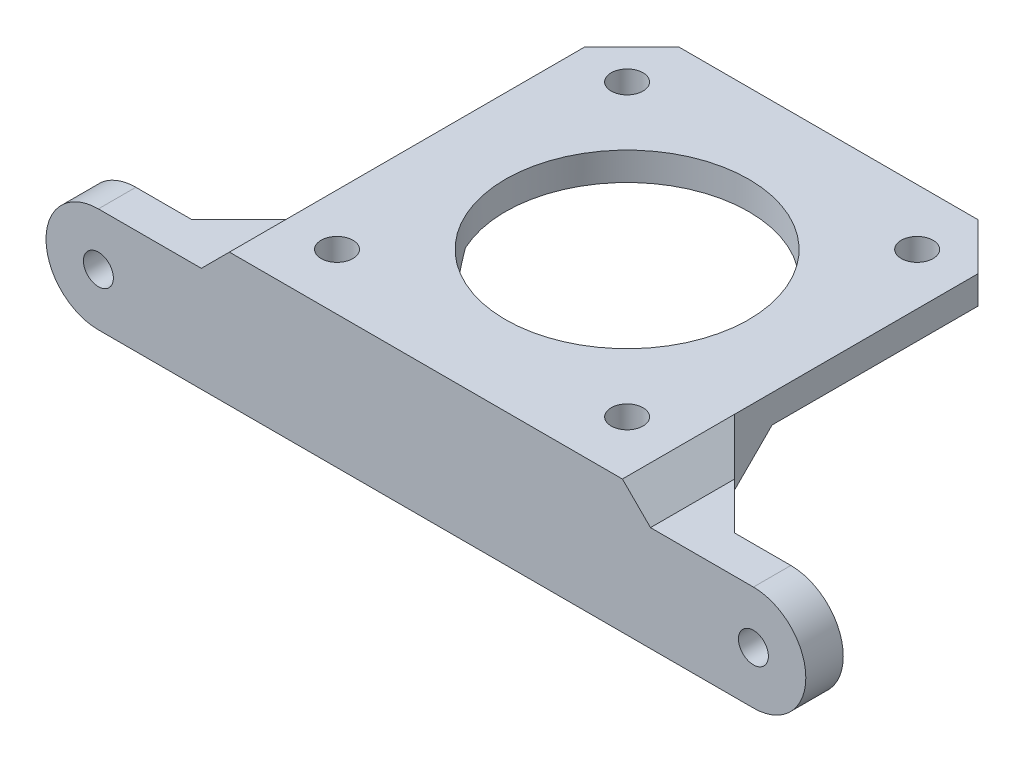
ISO-10303-21;
HEADER;
FILE_DESCRIPTION(('STEP AP214'),'2;1');
FILE_NAME('part.step','',(''),(''),'','','');
FILE_SCHEMA(('AUTOMOTIVE_DESIGN { 1 0 10303 214 1 1 1 1 }'));
ENDSEC;
DATA;
#1=APPLICATION_CONTEXT('core data for automotive mechanical design processes');
#2=APPLICATION_PROTOCOL_DEFINITION('international standard','automotive_design',2000,#1);
#3=PRODUCT_CONTEXT('',#1,'mechanical');
#4=PRODUCT('Part','Part','',(#3));
#5=PRODUCT_RELATED_PRODUCT_CATEGORY('part','',(#4));
#6=PRODUCT_DEFINITION_FORMATION('','',#4);
#7=PRODUCT_DEFINITION_CONTEXT('part definition',#1,'design');
#8=PRODUCT_DEFINITION('design','',#6,#7);
#9=PRODUCT_DEFINITION_SHAPE('','',#8);
#10=(LENGTH_UNIT() NAMED_UNIT(*) SI_UNIT(.MILLI.,.METRE.));
#11=(NAMED_UNIT(*) PLANE_ANGLE_UNIT() SI_UNIT($,.RADIAN.));
#12=(NAMED_UNIT(*) SI_UNIT($,.STERADIAN.) SOLID_ANGLE_UNIT());
#13=UNCERTAINTY_MEASURE_WITH_UNIT(LENGTH_MEASURE(1.E-05),#10,'distance_accuracy_value','');
#14=(GEOMETRIC_REPRESENTATION_CONTEXT(3) GLOBAL_UNCERTAINTY_ASSIGNED_CONTEXT((#13)) GLOBAL_UNIT_ASSIGNED_CONTEXT((#10,
#11,#12)) REPRESENTATION_CONTEXT('',''));
#15=CARTESIAN_POINT('',(0.,0.,0.));
#16=DIRECTION('',(0.,0.,1.));
#17=DIRECTION('',(1.,0.,0.));
#18=AXIS2_PLACEMENT_3D('',#15,#16,#17);
#19=CARTESIAN_POINT('',(0.,5.60000000000002,-12.0000000000002));
#20=DIRECTION('',(0.,-0.707106781186551,-0.707106781186544));
#21=DIRECTION('',(1.,0.,0.));
#22=AXIS2_PLACEMENT_3D('',#19,#20,#21);
#23=PLANE('',#22);
#24=CARTESIAN_POINT('',(15.5,-4.40000000000009,-1.99999999999999));
#25=DIRECTION('',(0.,-0.707106781186551,-0.707106781186544));
#26=DIRECTION('',(0.,0.707106781186544,-0.707106781186551));
#27=AXIS2_PLACEMENT_3D('',#24,#25,#26);
#28=ELLIPSE('',#27,4.94974746830582,3.50000000000001);
#29=CARTESIAN_POINT('',(12.2121435554452,-5.60000000000003,-0.800000000000068));
#30=VERTEX_POINT('',#29);
#31=CARTESIAN_POINT('',(18.7878564445547,-5.6,-0.800000000000068));
#32=VERTEX_POINT('',#31);
#33=EDGE_CURVE('E176',#30,#32,#28,.T.);
#34=ORIENTED_EDGE('',*,*,#33,.F.);
#35=DIRECTION('',(-1.,0.,0.));
#36=VECTOR('',#35,1.);
#37=CARTESIAN_POINT('',(-35.,-5.60000000000001,-0.800000000000069));
#38=LINE('',#37,#36);
#39=CARTESIAN_POINT('',(-12.2121435554453,-5.60000000000004,-0.80000000000004));
#40=VERTEX_POINT('',#39);
#41=EDGE_CURVE('E184',#40,#30,#38,.F.);
#42=ORIENTED_EDGE('',*,*,#41,.F.);
#43=CARTESIAN_POINT('',(-15.5,-4.4000000000001,-1.99999999999999));
#44=DIRECTION('',(0.,-0.707106781186551,-0.707106781186544));
#45=DIRECTION('',(0.,0.707106781186544,-0.707106781186551));
#46=AXIS2_PLACEMENT_3D('',#43,#44,#45);
#47=ELLIPSE('',#46,4.94974746830581,3.5);
#48=CARTESIAN_POINT('',(-18.7878564445547,-5.60000000000001,-0.800000000000069));
#49=VERTEX_POINT('',#48);
#50=EDGE_CURVE('E199',#49,#40,#47,.T.);
#51=ORIENTED_EDGE('',*,*,#50,.F.);
#52=CARTESIAN_POINT('',(-28.2,-5.60000000000001,-0.800000000000069));
#53=VERTEX_POINT('',#52);
#54=EDGE_CURVE('E48',#53,#49,#38,.F.);
#55=ORIENTED_EDGE('',*,*,#54,.F.);
#56=DIRECTION('',(0.577350269189624,0.577350269189624,-0.57735026918963));
#57=VECTOR('',#56,1.);
#58=CARTESIAN_POINT('',(-11.3333333333333,11.2666666666666,-17.6666666666669));
#59=LINE('',#58,#57);
#60=CARTESIAN_POINT('',(-21.,1.59999999999998,-8.00000000000014));
#61=VERTEX_POINT('',#60);
#62=EDGE_CURVE('E11',#53,#61,#59,.T.);
#63=ORIENTED_EDGE('',*,*,#62,.T.);
#64=DIRECTION('',(0.,0.707106781186544,-0.707106781186551));
#65=VECTOR('',#64,1.);
#66=CARTESIAN_POINT('',(-21.,20.5999999999999,-27.0000000000002));
#67=LINE('',#66,#65);
#68=CARTESIAN_POINT('',(-21.,5.60000000000002,-12.0000000000002));
#69=VERTEX_POINT('',#68);
#70=EDGE_CURVE('E194',#69,#61,#67,.F.);
#71=ORIENTED_EDGE('',*,*,#70,.F.);
#72=DIRECTION('',(-1.,0.,0.));
#73=VECTOR('',#72,1.);
#74=CARTESIAN_POINT('',(-21.,5.60000000000002,-12.0000000000002));
#75=LINE('',#74,#73);
#76=CARTESIAN_POINT('',(-11.7792189893898,5.60000000000002,-12.0000000000002));
#77=VERTEX_POINT('',#76);
#78=EDGE_CURVE('E255',#77,#69,#75,.T.);
#79=ORIENTED_EDGE('',*,*,#78,.F.);
#80=CARTESIAN_POINT('',(0.,11.0999999999998,-17.5));
#81=DIRECTION('',(0.,-0.707106781186551,-0.707106781186544));
#82=DIRECTION('',(0.,-0.707106781186544,0.707106781186551));
#83=AXIS2_PLACEMENT_3D('',#80,#81,#82);
#84=ELLIPSE('',#83,18.3847763108501,13.);
#85=CARTESIAN_POINT('',(11.7792189893898,5.60000000000002,-12.0000000000002));
#86=VERTEX_POINT('',#85);
#87=EDGE_CURVE('E249',#86,#77,#84,.T.);
#88=ORIENTED_EDGE('',*,*,#87,.F.);
#89=DIRECTION('',(-1.,0.,0.));
#90=VECTOR('',#89,1.);
#91=CARTESIAN_POINT('',(-21.,5.60000000000002,-12.0000000000002));
#92=LINE('',#91,#90);
#93=CARTESIAN_POINT('',(21.,5.60000000000002,-12.0000000000002));
#94=VERTEX_POINT('',#93);
#95=EDGE_CURVE('E250',#94,#86,#92,.T.);
#96=ORIENTED_EDGE('',*,*,#95,.F.);
#97=DIRECTION('',(0.,-0.707106781186544,0.707106781186551));
#98=VECTOR('',#97,1.);
#99=CARTESIAN_POINT('',(21.,20.5999999999999,-27.0000000000002));
#100=LINE('',#99,#98);
#101=CARTESIAN_POINT('',(21.,1.59999999999999,-8.00000000000014));
#102=VERTEX_POINT('',#101);
#103=EDGE_CURVE('E193',#102,#94,#100,.F.);
#104=ORIENTED_EDGE('',*,*,#103,.F.);
#105=DIRECTION('',(0.577350269189623,-0.577350269189624,0.57735026918963));
#106=VECTOR('',#105,1.);
#107=CARTESIAN_POINT('',(11.3333333333334,11.2666666666666,-17.6666666666669));
#108=LINE('',#107,#106);
#109=CARTESIAN_POINT('',(28.2,-5.6,-0.800000000000068));
#110=VERTEX_POINT('',#109);
#111=EDGE_CURVE('E217',#102,#110,#108,.T.);
#112=ORIENTED_EDGE('',*,*,#111,.T.);
#113=EDGE_CURVE('E186',#32,#110,#38,.F.);
#114=ORIENTED_EDGE('',*,*,#113,.F.);
#115=EDGE_LOOP('',(#34,#42,#51,#55,#63,#71,#79,#88,#96,#104,#112,#114));
#116=FACE_BOUND('',#115,.T.);
#117=ADVANCED_FACE('F32',(#116),#23,.T.);
#118=CARTESIAN_POINT('',(15.5,-5.60000000000002,-1.99999999999999));
#119=DIRECTION('',(0.,1.,0.));
#120=DIRECTION('',(-1.,0.,0.));
#121=AXIS2_PLACEMENT_3D('',#118,#119,#120);
#122=CYLINDRICAL_SURFACE('',#121,1.7);
#123=CARTESIAN_POINT('',(15.5,8.60000000000002,-1.99999999999999));
#124=DIRECTION('',(0.,1.,0.));
#125=DIRECTION('',(-1.,0.,0.));
#126=AXIS2_PLACEMENT_3D('',#123,#124,#125);
#127=CIRCLE('',#126,1.7);
#128=CARTESIAN_POINT('',(13.8,8.60000000000002,-1.99999999999999));
#129=VERTEX_POINT('',#128);
#130=EDGE_CURVE('E363',#129,#129,#127,.T.);
#131=ORIENTED_EDGE('',*,*,#130,.T.);
#132=EDGE_LOOP('',(#131));
#133=FACE_BOUND('',#132,.T.);
#134=CARTESIAN_POINT('',(15.5,5.60000000000002,-1.99999999999999));
#135=DIRECTION('',(0.,-1.,0.));
#136=DIRECTION('',(1.,0.,0.));
#137=AXIS2_PLACEMENT_3D('',#134,#135,#136);
#138=CIRCLE('',#137,1.7);
#139=CARTESIAN_POINT('',(17.2,5.60000000000002,-1.99999999999999));
#140=VERTEX_POINT('',#139);
#141=EDGE_CURVE('E180',#140,#140,#138,.F.);
#142=ORIENTED_EDGE('',*,*,#141,.F.);
#143=EDGE_LOOP('',(#142));
#144=FACE_BOUND('',#143,.T.);
#145=ADVANCED_FACE('F390',(#133,#144),#122,.F.);
#146=CARTESIAN_POINT('',(-15.5,-5.60000000000003,-1.99999999999999));
#147=DIRECTION('',(0.,1.,0.));
#148=DIRECTION('',(-1.,0.,0.));
#149=AXIS2_PLACEMENT_3D('',#146,#147,#148);
#150=CYLINDRICAL_SURFACE('',#149,1.7);
#151=CARTESIAN_POINT('',(-15.5,8.60000000000002,-1.99999999999999));
#152=DIRECTION('',(0.,1.,0.));
#153=DIRECTION('',(1.,0.,0.));
#154=AXIS2_PLACEMENT_3D('',#151,#152,#153);
#155=CIRCLE('',#154,1.7);
#156=CARTESIAN_POINT('',(-13.8,8.60000000000002,-1.99999999999999));
#157=VERTEX_POINT('',#156);
#158=EDGE_CURVE('E203',#157,#157,#155,.T.);
#159=ORIENTED_EDGE('',*,*,#158,.T.);
#160=EDGE_LOOP('',(#159));
#161=FACE_BOUND('',#160,.T.);
#162=CARTESIAN_POINT('',(-15.5,5.60000000000002,-1.99999999999999));
#163=DIRECTION('',(0.,-1.,0.));
#164=DIRECTION('',(1.,0.,0.));
#165=AXIS2_PLACEMENT_3D('',#162,#163,#164);
#166=CIRCLE('',#165,1.7);
#167=CARTESIAN_POINT('',(-13.8,5.60000000000002,-1.99999999999999));
#168=VERTEX_POINT('',#167);
#169=EDGE_CURVE('E200',#168,#168,#166,.F.);
#170=ORIENTED_EDGE('',*,*,#169,.F.);
#171=EDGE_LOOP('',(#170));
#172=FACE_BOUND('',#171,.T.);
#173=ADVANCED_FACE('F395',(#161,#172),#150,.F.);
#174=CARTESIAN_POINT('',(-35.,0.,0.));
#175=DIRECTION('',(0.,0.,1.));
#176=DIRECTION('',(1.,0.,0.));
#177=AXIS2_PLACEMENT_3D('',#174,#175,#176);
#178=PLANE('',#177);
#179=CARTESIAN_POINT('',(-35.,0.,0.));
#180=DIRECTION('',(0.,0.,1.));
#181=DIRECTION('',(1.,0.,0.));
#182=AXIS2_PLACEMENT_3D('',#179,#180,#181);
#183=CIRCLE('',#182,1.60000000000001);
#184=CARTESIAN_POINT('',(-33.4,0.,0.));
#185=VERTEX_POINT('',#184);
#186=EDGE_CURVE('E325',#185,#185,#183,.T.);
#187=ORIENTED_EDGE('',*,*,#186,.T.);
#188=EDGE_LOOP('',(#187));
#189=FACE_BOUND('',#188,.T.);
#190=DIRECTION('',(-1.,0.,0.));
#191=VECTOR('',#190,1.);
#192=CARTESIAN_POINT('',(-35.,5.60000000000001,0.));
#193=LINE('',#192,#191);
#194=CARTESIAN_POINT('',(-29.0000000000001,5.60000000000001,0.));
#195=VERTEX_POINT('',#194);
#196=CARTESIAN_POINT('',(-35.,5.60000000000001,0.));
#197=VERTEX_POINT('',#196);
#198=EDGE_CURVE('E301',#195,#197,#193,.T.);
#199=ORIENTED_EDGE('',*,*,#198,.F.);
#200=DIRECTION('',(0.,-1.,0.));
#201=VECTOR('',#200,1.);
#202=CARTESIAN_POINT('',(-29.0000000000001,-5.60000000000001,0.));
#203=LINE('',#202,#201);
#204=CARTESIAN_POINT('',(-29.0000000000001,-5.60000000000001,0.));
#205=VERTEX_POINT('',#204);
#206=EDGE_CURVE('E215',#195,#205,#203,.T.);
#207=ORIENTED_EDGE('',*,*,#206,.T.);
#208=DIRECTION('',(1.,0.,0.));
#209=VECTOR('',#208,1.);
#210=CARTESIAN_POINT('',(-35.,-5.60000000000001,0.));
#211=LINE('',#210,#209);
#212=CARTESIAN_POINT('',(-35.,-5.60000000000001,0.));
#213=VERTEX_POINT('',#212);
#214=EDGE_CURVE('E233',#213,#205,#211,.T.);
#215=ORIENTED_EDGE('',*,*,#214,.F.);
#216=CARTESIAN_POINT('',(-35.,0.,0.));
#217=DIRECTION('',(0.,0.,1.));
#218=DIRECTION('',(1.,0.,0.));
#219=AXIS2_PLACEMENT_3D('',#216,#217,#218);
#220=CIRCLE('',#219,5.60000000000001);
#221=EDGE_CURVE('E306',#197,#213,#220,.T.);
#222=ORIENTED_EDGE('',*,*,#221,.F.);
#223=EDGE_LOOP('',(#199,#207,#215,#222));
#224=FACE_BOUND('',#223,.T.);
#225=ADVANCED_FACE('F436',(#189,#224),#178,.F.);
#226=CARTESIAN_POINT('',(-35.,5.60000000000001,4.));
#227=DIRECTION('',(0.,-1.,0.));
#228=DIRECTION('',(1.,0.,0.));
#229=AXIS2_PLACEMENT_3D('',#226,#227,#228);
#230=PLANE('',#229);
#231=CARTESIAN_POINT('',(35.,5.60000000000003,0.));
#232=VERTEX_POINT('',#231);
#233=CARTESIAN_POINT('',(29.0000000000001,5.60000000000003,0.));
#234=VERTEX_POINT('',#233);
#235=EDGE_CURVE('E297',#232,#234,#193,.T.);
#236=ORIENTED_EDGE('',*,*,#235,.T.);
#237=DIRECTION('',(0.707106781186543,0.,0.707106781186552));
#238=VECTOR('',#237,1.);
#239=CARTESIAN_POINT('',(-0.999999999999605,5.60000000000002,-30.));
#240=LINE('',#239,#238);
#241=CARTESIAN_POINT('',(24.,5.60000000000002,-5.00000000000012));
#242=VERTEX_POINT('',#241);
#243=EDGE_CURVE('E221',#234,#242,#240,.F.);
#244=ORIENTED_EDGE('',*,*,#243,.T.);
#245=DIRECTION('',(0.,0.,1.));
#246=VECTOR('',#245,1.);
#247=CARTESIAN_POINT('',(24.,5.60000000000002,4.));
#248=LINE('',#247,#246);
#249=CARTESIAN_POINT('',(24.,5.60000000000002,4.));
#250=VERTEX_POINT('',#249);
#251=EDGE_CURVE('E68',#242,#250,#248,.T.);
#252=ORIENTED_EDGE('',*,*,#251,.T.);
#253=DIRECTION('',(-1.,0.,0.));
#254=VECTOR('',#253,1.);
#255=CARTESIAN_POINT('',(-35.,5.60000000000001,4.));
#256=LINE('',#255,#254);
#257=CARTESIAN_POINT('',(35.,5.60000000000003,4.));
#258=VERTEX_POINT('',#257);
#259=EDGE_CURVE('E296',#258,#250,#256,.T.);
#260=ORIENTED_EDGE('',*,*,#259,.F.);
#261=DIRECTION('',(0.,0.,-1.));
#262=VECTOR('',#261,1.);
#263=CARTESIAN_POINT('',(35.,5.60000000000003,4.));
#264=LINE('',#263,#262);
#265=EDGE_CURVE('E290',#258,#232,#264,.T.);
#266=ORIENTED_EDGE('',*,*,#265,.T.);
#267=EDGE_LOOP('',(#236,#244,#252,#260,#266));
#268=FACE_BOUND('',#267,.T.);
#269=ADVANCED_FACE('F412',(#268),#230,.F.);
#270=CARTESIAN_POINT('',(-24.,5.60000000000001,4.));
#271=VERTEX_POINT('',#270);
#272=CARTESIAN_POINT('',(-35.,5.60000000000001,4.));
#273=VERTEX_POINT('',#272);
#274=EDGE_CURVE('E312',#271,#273,#256,.T.);
#275=ORIENTED_EDGE('',*,*,#274,.F.);
#276=DIRECTION('',(0.,0.,-1.));
#277=VECTOR('',#276,1.);
#278=CARTESIAN_POINT('',(-24.,5.60000000000001,0.));
#279=LINE('',#278,#277);
#280=CARTESIAN_POINT('',(-24.,5.60000000000001,-5.00000000000011));
#281=VERTEX_POINT('',#280);
#282=EDGE_CURVE('E282',#271,#281,#279,.T.);
#283=ORIENTED_EDGE('',*,*,#282,.T.);
#284=DIRECTION('',(0.707106781186544,0.,-0.707106781186551));
#285=VECTOR('',#284,1.);
#286=CARTESIAN_POINT('',(-34.,5.60000000000001,4.99999999999999));
#287=LINE('',#286,#285);
#288=EDGE_CURVE('E228',#281,#195,#287,.F.);
#289=ORIENTED_EDGE('',*,*,#288,.T.);
#290=ORIENTED_EDGE('',*,*,#198,.T.);
#291=DIRECTION('',(0.,0.,-1.));
#292=VECTOR('',#291,1.);
#293=CARTESIAN_POINT('',(-35.,5.60000000000001,4.));
#294=LINE('',#293,#292);
#295=EDGE_CURVE('E293',#273,#197,#294,.T.);
#296=ORIENTED_EDGE('',*,*,#295,.F.);
#297=EDGE_LOOP('',(#275,#283,#289,#290,#296));
#298=FACE_BOUND('',#297,.T.);
#299=ADVANCED_FACE('F440',(#298),#230,.F.);
#300=CARTESIAN_POINT('',(-35.,0.,4.));
#301=DIRECTION('',(0.,0.,1.));
#302=DIRECTION('',(1.,0.,0.));
#303=AXIS2_PLACEMENT_3D('',#300,#301,#302);
#304=PLANE('',#303);
#305=CARTESIAN_POINT('',(35.,0.,4.));
#306=DIRECTION('',(0.,0.,1.));
#307=DIRECTION('',(1.,0.,0.));
#308=AXIS2_PLACEMENT_3D('',#305,#306,#307);
#309=CIRCLE('',#308,1.6);
#310=CARTESIAN_POINT('',(36.6,0.,4.));
#311=VERTEX_POINT('',#310);
#312=EDGE_CURVE('E309',#311,#311,#309,.T.);
#313=ORIENTED_EDGE('',*,*,#312,.F.);
#314=EDGE_LOOP('',(#313));
#315=FACE_BOUND('',#314,.T.);
#316=CARTESIAN_POINT('',(-35.,0.,4.));
#317=DIRECTION('',(0.,0.,1.));
#318=DIRECTION('',(1.,0.,0.));
#319=AXIS2_PLACEMENT_3D('',#316,#317,#318);
#320=CIRCLE('',#319,5.60000000000001);
#321=CARTESIAN_POINT('',(-35.,-5.60000000000001,4.));
#322=VERTEX_POINT('',#321);
#323=EDGE_CURVE('E300',#273,#322,#320,.T.);
#324=ORIENTED_EDGE('',*,*,#323,.T.);
#325=DIRECTION('',(1.,0.,0.));
#326=VECTOR('',#325,1.);
#327=CARTESIAN_POINT('',(-35.,-5.60000000000001,4.));
#328=LINE('',#327,#326);
#329=CARTESIAN_POINT('',(35.,-5.6,4.));
#330=VERTEX_POINT('',#329);
#331=EDGE_CURVE('E315',#322,#330,#328,.T.);
#332=ORIENTED_EDGE('',*,*,#331,.T.);
#333=CARTESIAN_POINT('',(35.,0.,4.));
#334=DIRECTION('',(0.,0.,1.));
#335=DIRECTION('',(1.,0.,0.));
#336=AXIS2_PLACEMENT_3D('',#333,#334,#335);
#337=CIRCLE('',#336,5.60000000000001);
#338=EDGE_CURVE('E313',#330,#258,#337,.T.);
#339=ORIENTED_EDGE('',*,*,#338,.T.);
#340=ORIENTED_EDGE('',*,*,#259,.T.);
#341=DIRECTION('',(0.707106781186544,-0.707106781186551,0.));
#342=VECTOR('',#341,1.);
#343=CARTESIAN_POINT('',(21.,8.60000000000004,4.));
#344=LINE('',#343,#342);
#345=CARTESIAN_POINT('',(21.,8.60000000000002,4.));
#346=VERTEX_POINT('',#345);
#347=EDGE_CURVE('E280',#250,#346,#344,.F.);
#348=ORIENTED_EDGE('',*,*,#347,.T.);
#349=DIRECTION('',(1.,0.,0.));
#350=VECTOR('',#349,1.);
#351=CARTESIAN_POINT('',(-21.,8.60000000000002,4.));
#352=LINE('',#351,#350);
#353=CARTESIAN_POINT('',(-21.,8.60000000000002,4.));
#354=VERTEX_POINT('',#353);
#355=EDGE_CURVE('E328',#354,#346,#352,.T.);
#356=ORIENTED_EDGE('',*,*,#355,.F.);
#357=DIRECTION('',(0.707106781186543,0.707106781186552,0.));
#358=VECTOR('',#357,1.);
#359=CARTESIAN_POINT('',(-21.,8.60000000000006,4.));
#360=LINE('',#359,#358);
#361=EDGE_CURVE('E278',#354,#271,#360,.F.);
#362=ORIENTED_EDGE('',*,*,#361,.T.);
#363=ORIENTED_EDGE('',*,*,#274,.T.);
#364=EDGE_LOOP('',(#324,#332,#339,#340,#348,#356,#362,#363));
#365=FACE_BOUND('',#364,.T.);
#366=CARTESIAN_POINT('',(-35.,0.,4.));
#367=DIRECTION('',(0.,0.,1.));
#368=DIRECTION('',(1.,0.,0.));
#369=AXIS2_PLACEMENT_3D('',#366,#367,#368);
#370=CIRCLE('',#369,1.60000000000001);
#371=CARTESIAN_POINT('',(-33.4,0.,4.));
#372=VERTEX_POINT('',#371);
#373=EDGE_CURVE('E322',#372,#372,#370,.T.);
#374=ORIENTED_EDGE('',*,*,#373,.F.);
#375=EDGE_LOOP('',(#374));
#376=FACE_BOUND('',#375,.T.);
#377=ADVANCED_FACE('F426',(#315,#365,#376),#304,.T.);
#378=CARTESIAN_POINT('',(29.0000000000001,-5.6,0.));
#379=VERTEX_POINT('',#378);
#380=CARTESIAN_POINT('',(35.,-5.6,0.));
#381=VERTEX_POINT('',#380);
#382=EDGE_CURVE('E305',#379,#381,#211,.T.);
#383=ORIENTED_EDGE('',*,*,#382,.F.);
#384=DIRECTION('',(0.,1.,0.));
#385=VECTOR('',#384,1.);
#386=CARTESIAN_POINT('',(29.,8.60000000000003,0.));
#387=LINE('',#386,#385);
#388=EDGE_CURVE('E210',#379,#234,#387,.T.);
#389=ORIENTED_EDGE('',*,*,#388,.T.);
#390=ORIENTED_EDGE('',*,*,#235,.F.);
#391=CARTESIAN_POINT('',(35.,0.,0.));
#392=DIRECTION('',(0.,0.,1.));
#393=DIRECTION('',(1.,0.,0.));
#394=AXIS2_PLACEMENT_3D('',#391,#392,#393);
#395=CIRCLE('',#394,5.60000000000001);
#396=EDGE_CURVE('E302',#381,#232,#395,.T.);
#397=ORIENTED_EDGE('',*,*,#396,.F.);
#398=EDGE_LOOP('',(#383,#389,#390,#397));
#399=FACE_BOUND('',#398,.T.);
#400=CARTESIAN_POINT('',(35.,0.,0.));
#401=DIRECTION('',(0.,0.,1.));
#402=DIRECTION('',(1.,0.,0.));
#403=AXIS2_PLACEMENT_3D('',#400,#401,#402);
#404=CIRCLE('',#403,1.6);
#405=CARTESIAN_POINT('',(36.6,0.,0.));
#406=VERTEX_POINT('',#405);
#407=EDGE_CURVE('E319',#406,#406,#404,.T.);
#408=ORIENTED_EDGE('',*,*,#407,.T.);
#409=EDGE_LOOP('',(#408));
#410=FACE_BOUND('',#409,.T.);
#411=ADVANCED_FACE('F419',(#399,#410),#178,.F.);
#412=CARTESIAN_POINT('',(-35.,0.,4.));
#413=DIRECTION('',(0.,0.,-1.));
#414=DIRECTION('',(-1.,0.,0.));
#415=AXIS2_PLACEMENT_3D('',#412,#413,#414);
#416=CYLINDRICAL_SURFACE('',#415,5.60000000000001);
#417=ORIENTED_EDGE('',*,*,#221,.T.);
#418=DIRECTION('',(0.,0.,-1.));
#419=VECTOR('',#418,1.);
#420=CARTESIAN_POINT('',(-35.,-5.60000000000001,4.));
#421=LINE('',#420,#419);
#422=EDGE_CURVE('E285',#322,#213,#421,.T.);
#423=ORIENTED_EDGE('',*,*,#422,.F.);
#424=ORIENTED_EDGE('',*,*,#323,.F.);
#425=ORIENTED_EDGE('',*,*,#295,.T.);
#426=EDGE_LOOP('',(#417,#423,#424,#425));
#427=FACE_BOUND('',#426,.T.);
#428=ADVANCED_FACE('F432',(#427),#416,.T.);
#429=CARTESIAN_POINT('',(-35.,-5.60000000000001,4.));
#430=DIRECTION('',(0.,1.,0.));
#431=DIRECTION('',(-1.,0.,0.));
#432=AXIS2_PLACEMENT_3D('',#429,#430,#431);
#433=PLANE('',#432);
#434=CARTESIAN_POINT('',(15.5,-5.60000000000003,-1.99999999999999));
#435=DIRECTION('',(0.,-1.,0.));
#436=DIRECTION('',(1.,0.,0.));
#437=AXIS2_PLACEMENT_3D('',#434,#435,#436);
#438=CIRCLE('',#437,3.50000000000001);
#439=EDGE_CURVE('E173',#32,#30,#438,.T.);
#440=ORIENTED_EDGE('',*,*,#439,.F.);
#441=ORIENTED_EDGE('',*,*,#113,.T.);
#442=DIRECTION('',(-0.707106781186543,0.,-0.707106781186552));
#443=VECTOR('',#442,1.);
#444=CARTESIAN_POINT('',(-0.999999999999605,-5.60000000000001,-30.));
#445=LINE('',#444,#443);
#446=EDGE_CURVE('E219',#110,#379,#445,.F.);
#447=ORIENTED_EDGE('',*,*,#446,.T.);
#448=ORIENTED_EDGE('',*,*,#382,.T.);
#449=DIRECTION('',(0.,0.,-1.));
#450=VECTOR('',#449,1.);
#451=CARTESIAN_POINT('',(35.,-5.6,4.));
#452=LINE('',#451,#450);
#453=EDGE_CURVE('E287',#330,#381,#452,.T.);
#454=ORIENTED_EDGE('',*,*,#453,.F.);
#455=ORIENTED_EDGE('',*,*,#331,.F.);
#456=ORIENTED_EDGE('',*,*,#422,.T.);
#457=ORIENTED_EDGE('',*,*,#214,.T.);
#458=DIRECTION('',(-0.707106781186544,0.,0.707106781186551));
#459=VECTOR('',#458,1.);
#460=CARTESIAN_POINT('',(-34.,-5.60000000000001,4.99999999999999));
#461=LINE('',#460,#459);
#462=EDGE_CURVE('E41',#205,#53,#461,.F.);
#463=ORIENTED_EDGE('',*,*,#462,.T.);
#464=ORIENTED_EDGE('',*,*,#54,.T.);
#465=CARTESIAN_POINT('',(-15.5,-5.60000000000004,-1.99999999999999));
#466=DIRECTION('',(0.,-1.,0.));
#467=DIRECTION('',(1.,0.,0.));
#468=AXIS2_PLACEMENT_3D('',#465,#466,#467);
#469=CIRCLE('',#468,3.5);
#470=EDGE_CURVE('E191',#40,#49,#469,.T.);
#471=ORIENTED_EDGE('',*,*,#470,.F.);
#472=ORIENTED_EDGE('',*,*,#41,.T.);
#473=EDGE_LOOP('',(#440,#441,#447,#448,#454,#455,#456,#457,#463,#464,#471,#472));
#474=FACE_BOUND('',#473,.T.);
#475=ADVANCED_FACE('F190',(#474),#433,.F.);
#476=CARTESIAN_POINT('',(35.,0.,4.));
#477=DIRECTION('',(0.,0.,-1.));
#478=DIRECTION('',(-1.,0.,0.));
#479=AXIS2_PLACEMENT_3D('',#476,#477,#478);
#480=CYLINDRICAL_SURFACE('',#479,5.60000000000001);
#481=ORIENTED_EDGE('',*,*,#396,.T.);
#482=ORIENTED_EDGE('',*,*,#265,.F.);
#483=ORIENTED_EDGE('',*,*,#338,.F.);
#484=ORIENTED_EDGE('',*,*,#453,.T.);
#485=EDGE_LOOP('',(#481,#482,#483,#484));
#486=FACE_BOUND('',#485,.T.);
#487=ADVANCED_FACE('F424',(#486),#480,.T.);
#488=CARTESIAN_POINT('',(35.,0.,4.));
#489=DIRECTION('',(0.,0.,-1.));
#490=DIRECTION('',(-1.,0.,0.));
#491=AXIS2_PLACEMENT_3D('',#488,#489,#490);
#492=CYLINDRICAL_SURFACE('',#491,1.6);
#493=ORIENTED_EDGE('',*,*,#312,.T.);
#494=EDGE_LOOP('',(#493));
#495=FACE_BOUND('',#494,.T.);
#496=ORIENTED_EDGE('',*,*,#407,.F.);
#497=EDGE_LOOP('',(#496));
#498=FACE_BOUND('',#497,.T.);
#499=ADVANCED_FACE('F486',(#495,#498),#492,.F.);
#500=CARTESIAN_POINT('',(-35.,0.,4.));
#501=DIRECTION('',(0.,0.,-1.));
#502=DIRECTION('',(-1.,0.,0.));
#503=AXIS2_PLACEMENT_3D('',#500,#501,#502);
#504=CYLINDRICAL_SURFACE('',#503,1.60000000000001);
#505=ORIENTED_EDGE('',*,*,#373,.T.);
#506=EDGE_LOOP('',(#505));
#507=FACE_BOUND('',#506,.T.);
#508=ORIENTED_EDGE('',*,*,#186,.F.);
#509=EDGE_LOOP('',(#508));
#510=FACE_BOUND('',#509,.T.);
#511=ADVANCED_FACE('F477',(#507,#510),#504,.F.);
#512=CARTESIAN_POINT('',(0.,5.60000000000002,0.));
#513=DIRECTION('',(0.,1.,0.));
#514=DIRECTION('',(-1.,0.,0.));
#515=AXIS2_PLACEMENT_3D('',#512,#513,#514);
#516=PLANE('',#515);
#517=DIRECTION('',(0.,0.,-1.));
#518=VECTOR('',#517,1.);
#519=CARTESIAN_POINT('',(21.,5.60000000000002,-39.));
#520=LINE('',#519,#518);
#521=CARTESIAN_POINT('',(21.,5.60000000000002,-34.));
#522=VERTEX_POINT('',#521);
#523=EDGE_CURVE('E336',#94,#522,#520,.T.);
#524=ORIENTED_EDGE('',*,*,#523,.F.);
#525=ORIENTED_EDGE('',*,*,#95,.T.);
#526=CARTESIAN_POINT('',(0.,5.60000000000002,-17.5));
#527=DIRECTION('',(0.,1.,0.));
#528=DIRECTION('',(-1.,0.,0.));
#529=AXIS2_PLACEMENT_3D('',#526,#527,#528);
#530=CIRCLE('',#529,13.);
#531=EDGE_CURVE('E347',#86,#77,#530,.T.);
#532=ORIENTED_EDGE('',*,*,#531,.T.);
#533=ORIENTED_EDGE('',*,*,#78,.T.);
#534=DIRECTION('',(0.,0.,1.));
#535=VECTOR('',#534,1.);
#536=CARTESIAN_POINT('',(-21.,5.60000000000002,-39.));
#537=LINE('',#536,#535);
#538=CARTESIAN_POINT('',(-21.,5.60000000000002,-34.));
#539=VERTEX_POINT('',#538);
#540=EDGE_CURVE('E248',#539,#69,#537,.T.);
#541=ORIENTED_EDGE('',*,*,#540,.F.);
#542=DIRECTION('',(-0.707106781186549,0.,0.707106781186547));
#543=VECTOR('',#542,1.);
#544=CARTESIAN_POINT('',(-21.,5.60000000000002,-34.));
#545=LINE('',#544,#543);
#546=CARTESIAN_POINT('',(-16.,5.60000000000002,-39.));
#547=VERTEX_POINT('',#546);
#548=EDGE_CURVE('E271',#539,#547,#545,.F.);
#549=ORIENTED_EDGE('',*,*,#548,.T.);
#550=DIRECTION('',(-1.,0.,0.));
#551=VECTOR('',#550,1.);
#552=CARTESIAN_POINT('',(-21.,5.60000000000002,-39.));
#553=LINE('',#552,#551);
#554=CARTESIAN_POINT('',(16.,5.60000000000002,-39.));
#555=VERTEX_POINT('',#554);
#556=EDGE_CURVE('E333',#555,#547,#553,.T.);
#557=ORIENTED_EDGE('',*,*,#556,.F.);
#558=DIRECTION('',(-0.707106781186545,0.,-0.70710678118655));
#559=VECTOR('',#558,1.);
#560=CARTESIAN_POINT('',(16.,5.60000000000002,-39.));
#561=LINE('',#560,#559);
#562=EDGE_CURVE('E268',#555,#522,#561,.F.);
#563=ORIENTED_EDGE('',*,*,#562,.T.);
#564=EDGE_LOOP('',(#524,#525,#532,#533,#541,#549,#557,#563));
#565=FACE_BOUND('',#564,.T.);
#566=CARTESIAN_POINT('',(-15.5,5.60000000000002,-33.));
#567=DIRECTION('',(0.,1.,0.));
#568=DIRECTION('',(-1.,0.,0.));
#569=AXIS2_PLACEMENT_3D('',#566,#567,#568);
#570=CIRCLE('',#569,1.7);
#571=CARTESIAN_POINT('',(-17.2,5.60000000000002,-33.));
#572=VERTEX_POINT('',#571);
#573=EDGE_CURVE('E349',#572,#572,#570,.T.);
#574=ORIENTED_EDGE('',*,*,#573,.T.);
#575=EDGE_LOOP('',(#574));
#576=FACE_BOUND('',#575,.T.);
#577=CARTESIAN_POINT('',(15.5,5.60000000000002,-33.));
#578=DIRECTION('',(0.,1.,0.));
#579=DIRECTION('',(-1.,0.,0.));
#580=AXIS2_PLACEMENT_3D('',#577,#578,#579);
#581=CIRCLE('',#580,1.7);
#582=CARTESIAN_POINT('',(13.8,5.60000000000002,-33.));
#583=VERTEX_POINT('',#582);
#584=EDGE_CURVE('E357',#583,#583,#581,.T.);
#585=ORIENTED_EDGE('',*,*,#584,.T.);
#586=EDGE_LOOP('',(#585));
#587=FACE_BOUND('',#586,.T.);
#588=ADVANCED_FACE('F456',(#565,#576,#587),#516,.F.);
#589=CARTESIAN_POINT('',(0.,8.60000000000002,0.));
#590=DIRECTION('',(0.,1.,0.));
#591=DIRECTION('',(-1.,0.,0.));
#592=AXIS2_PLACEMENT_3D('',#589,#590,#591);
#593=PLANE('',#592);
#594=CARTESIAN_POINT('',(15.5,8.60000000000002,-33.));
#595=DIRECTION('',(0.,1.,0.));
#596=DIRECTION('',(1.,0.,0.));
#597=AXIS2_PLACEMENT_3D('',#594,#595,#596);
#598=CIRCLE('',#597,1.7);
#599=CARTESIAN_POINT('',(17.2,8.60000000000002,-33.));
#600=VERTEX_POINT('',#599);
#601=EDGE_CURVE('E360',#600,#600,#598,.T.);
#602=ORIENTED_EDGE('',*,*,#601,.F.);
#603=EDGE_LOOP('',(#602));
#604=FACE_BOUND('',#603,.T.);
#605=ORIENTED_EDGE('',*,*,#130,.F.);
#606=EDGE_LOOP('',(#605));
#607=FACE_BOUND('',#606,.T.);
#608=ORIENTED_EDGE('',*,*,#158,.F.);
#609=EDGE_LOOP('',(#608));
#610=FACE_BOUND('',#609,.T.);
#611=CARTESIAN_POINT('',(-15.5,8.60000000000002,-33.));
#612=DIRECTION('',(0.,1.,0.));
#613=DIRECTION('',(-1.,0.,0.));
#614=AXIS2_PLACEMENT_3D('',#611,#612,#613);
#615=CIRCLE('',#614,1.7);
#616=CARTESIAN_POINT('',(-17.2,8.60000000000002,-33.));
#617=VERTEX_POINT('',#616);
#618=EDGE_CURVE('E354',#617,#617,#615,.T.);
#619=ORIENTED_EDGE('',*,*,#618,.F.);
#620=EDGE_LOOP('',(#619));
#621=FACE_BOUND('',#620,.T.);
#622=DIRECTION('',(0.,0.,-1.));
#623=VECTOR('',#622,1.);
#624=CARTESIAN_POINT('',(21.,8.60000000000002,-39.));
#625=LINE('',#624,#623);
#626=CARTESIAN_POINT('',(21.,8.60000000000002,-8.00000000000014));
#627=VERTEX_POINT('',#626);
#628=EDGE_CURVE('E60',#346,#627,#625,.T.);
#629=ORIENTED_EDGE('',*,*,#628,.T.);
#630=CARTESIAN_POINT('',(21.,8.60000000000002,-34.));
#631=VERTEX_POINT('',#630);
#632=EDGE_CURVE('E332',#627,#631,#625,.T.);
#633=ORIENTED_EDGE('',*,*,#632,.T.);
#634=DIRECTION('',(0.707106781186545,0.,0.70710678118655));
#635=VECTOR('',#634,1.);
#636=CARTESIAN_POINT('',(27.5,8.60000000000003,-27.4999999999999));
#637=LINE('',#636,#635);
#638=CARTESIAN_POINT('',(16.,8.60000000000002,-39.));
#639=VERTEX_POINT('',#638);
#640=EDGE_CURVE('E261',#631,#639,#637,.F.);
#641=ORIENTED_EDGE('',*,*,#640,.T.);
#642=DIRECTION('',(-1.,0.,0.));
#643=VECTOR('',#642,1.);
#644=CARTESIAN_POINT('',(-21.,8.60000000000002,-39.));
#645=LINE('',#644,#643);
#646=CARTESIAN_POINT('',(-16.,8.60000000000002,-39.));
#647=VERTEX_POINT('',#646);
#648=EDGE_CURVE('E343',#639,#647,#645,.T.);
#649=ORIENTED_EDGE('',*,*,#648,.T.);
#650=DIRECTION('',(0.707106781186549,0.,-0.707106781186547));
#651=VECTOR('',#650,1.);
#652=CARTESIAN_POINT('',(-27.5,8.60000000000002,-27.5000000000001));
#653=LINE('',#652,#651);
#654=CARTESIAN_POINT('',(-21.,8.60000000000002,-34.));
#655=VERTEX_POINT('',#654);
#656=EDGE_CURVE('E263',#647,#655,#653,.F.);
#657=ORIENTED_EDGE('',*,*,#656,.T.);
#658=DIRECTION('',(0.,0.,1.));
#659=VECTOR('',#658,1.);
#660=CARTESIAN_POINT('',(-21.,8.60000000000002,-39.));
#661=LINE('',#660,#659);
#662=CARTESIAN_POINT('',(-21.,8.60000000000002,-8.00000000000014));
#663=VERTEX_POINT('',#662);
#664=EDGE_CURVE('E340',#655,#663,#661,.T.);
#665=ORIENTED_EDGE('',*,*,#664,.T.);
#666=EDGE_CURVE('E342',#663,#354,#661,.T.);
#667=ORIENTED_EDGE('',*,*,#666,.T.);
#668=ORIENTED_EDGE('',*,*,#355,.T.);
#669=EDGE_LOOP('',(#629,#633,#641,#649,#657,#665,#667,#668));
#670=FACE_BOUND('',#669,.T.);
#671=CARTESIAN_POINT('',(0.,8.60000000000002,-17.5));
#672=DIRECTION('',(0.,1.,0.));
#673=DIRECTION('',(-1.,0.,0.));
#674=AXIS2_PLACEMENT_3D('',#671,#672,#673);
#675=CIRCLE('',#674,13.);
#676=CARTESIAN_POINT('',(-13.,8.60000000000002,-17.5));
#677=VERTEX_POINT('',#676);
#678=EDGE_CURVE('E338',#677,#677,#675,.T.);
#679=ORIENTED_EDGE('',*,*,#678,.F.);
#680=EDGE_LOOP('',(#679));
#681=FACE_BOUND('',#680,.T.);
#682=ADVANCED_FACE('F447',(#604,#607,#610,#621,#670,#681),#593,.T.);
#683=CARTESIAN_POINT('',(21.,8.60000000000002,-39.));
#684=DIRECTION('',(-1.,0.,0.));
#685=DIRECTION('',(0.,-1.,0.));
#686=AXIS2_PLACEMENT_3D('',#683,#684,#685);
#687=PLANE('',#686);
#688=ORIENTED_EDGE('',*,*,#632,.F.);
#689=DIRECTION('',(0.,-1.,0.));
#690=VECTOR('',#689,1.);
#691=CARTESIAN_POINT('',(21.,-5.6,-8.00000000000014));
#692=LINE('',#691,#690);
#693=EDGE_CURVE('E205',#627,#102,#692,.T.);
#694=ORIENTED_EDGE('',*,*,#693,.T.);
#695=ORIENTED_EDGE('',*,*,#103,.T.);
#696=ORIENTED_EDGE('',*,*,#523,.T.);
#697=DIRECTION('',(0.,1.,0.));
#698=VECTOR('',#697,1.);
#699=CARTESIAN_POINT('',(21.,8.60000000000002,-34.));
#700=LINE('',#699,#698);
#701=EDGE_CURVE('E265',#522,#631,#700,.T.);
#702=ORIENTED_EDGE('',*,*,#701,.T.);
#703=EDGE_LOOP('',(#688,#694,#695,#696,#702));
#704=FACE_BOUND('',#703,.T.);
#705=ADVANCED_FACE('F452',(#704),#687,.F.);
#706=CARTESIAN_POINT('',(-21.,8.60000000000002,-39.));
#707=DIRECTION('',(0.,0.,1.));
#708=DIRECTION('',(1.,0.,0.));
#709=AXIS2_PLACEMENT_3D('',#706,#707,#708);
#710=PLANE('',#709);
#711=ORIENTED_EDGE('',*,*,#648,.F.);
#712=DIRECTION('',(0.,-1.,0.));
#713=VECTOR('',#712,1.);
#714=CARTESIAN_POINT('',(16.,8.60000000000002,-39.));
#715=LINE('',#714,#713);
#716=EDGE_CURVE('E273',#639,#555,#715,.T.);
#717=ORIENTED_EDGE('',*,*,#716,.T.);
#718=ORIENTED_EDGE('',*,*,#556,.T.);
#719=DIRECTION('',(0.,1.,0.));
#720=VECTOR('',#719,1.);
#721=CARTESIAN_POINT('',(-16.,8.60000000000002,-39.));
#722=LINE('',#721,#720);
#723=EDGE_CURVE('E276',#547,#647,#722,.T.);
#724=ORIENTED_EDGE('',*,*,#723,.T.);
#725=EDGE_LOOP('',(#711,#717,#718,#724));
#726=FACE_BOUND('',#725,.T.);
#727=ADVANCED_FACE('F467',(#726),#710,.F.);
#728=CARTESIAN_POINT('',(-21.,8.60000000000002,-39.));
#729=DIRECTION('',(1.,0.,0.));
#730=DIRECTION('',(0.,1.,0.));
#731=AXIS2_PLACEMENT_3D('',#728,#729,#730);
#732=PLANE('',#731);
#733=ORIENTED_EDGE('',*,*,#70,.T.);
#734=DIRECTION('',(0.,1.,0.));
#735=VECTOR('',#734,1.);
#736=CARTESIAN_POINT('',(-21.,8.60000000000002,-8.00000000000014));
#737=LINE('',#736,#735);
#738=EDGE_CURVE('E212',#61,#663,#737,.T.);
#739=ORIENTED_EDGE('',*,*,#738,.T.);
#740=ORIENTED_EDGE('',*,*,#664,.F.);
#741=DIRECTION('',(0.,-1.,0.));
#742=VECTOR('',#741,1.);
#743=CARTESIAN_POINT('',(-21.,8.60000000000002,-34.));
#744=LINE('',#743,#742);
#745=EDGE_CURVE('E259',#655,#539,#744,.T.);
#746=ORIENTED_EDGE('',*,*,#745,.T.);
#747=ORIENTED_EDGE('',*,*,#540,.T.);
#748=EDGE_LOOP('',(#733,#739,#740,#746,#747));
#749=FACE_BOUND('',#748,.T.);
#750=ADVANCED_FACE('F243',(#749),#732,.F.);
#751=CARTESIAN_POINT('',(0.,8.60000000000002,-17.5));
#752=DIRECTION('',(0.,-1.,0.));
#753=DIRECTION('',(1.,0.,0.));
#754=AXIS2_PLACEMENT_3D('',#751,#752,#753);
#755=CYLINDRICAL_SURFACE('',#754,13.);
#756=ORIENTED_EDGE('',*,*,#678,.T.);
#757=EDGE_LOOP('',(#756));
#758=FACE_BOUND('',#757,.T.);
#759=ORIENTED_EDGE('',*,*,#531,.F.);
#760=ORIENTED_EDGE('',*,*,#87,.T.);
#761=EDGE_LOOP('',(#759,#760));
#762=FACE_BOUND('',#761,.T.);
#763=ADVANCED_FACE('F458',(#758,#762),#755,.F.);
#764=CARTESIAN_POINT('',(21.,8.60000000000004,-39.));
#765=DIRECTION('',(0.707106781186551,0.707106781186544,0.));
#766=DIRECTION('',(0.,0.,1.));
#767=AXIS2_PLACEMENT_3D('',#764,#765,#766);
#768=PLANE('',#767);
#769=ORIENTED_EDGE('',*,*,#347,.F.);
#770=ORIENTED_EDGE('',*,*,#251,.F.);
#771=DIRECTION('',(-0.577350269189622,0.577350269189627,-0.577350269189629));
#772=VECTOR('',#771,1.);
#773=CARTESIAN_POINT('',(10.6666666666667,18.9333333333334,-18.3333333333335));
#774=LINE('',#773,#772);
#775=EDGE_CURVE('E223',#242,#627,#774,.T.);
#776=ORIENTED_EDGE('',*,*,#775,.T.);
#777=ORIENTED_EDGE('',*,*,#628,.F.);
#778=EDGE_LOOP('',(#769,#770,#776,#777));
#779=FACE_BOUND('',#778,.T.);
#780=ADVANCED_FACE('F449',(#779),#768,.T.);
#781=CARTESIAN_POINT('',(-21.,8.60000000000006,-39.));
#782=DIRECTION('',(-0.707106781186552,0.707106781186543,0.));
#783=DIRECTION('',(0.,0.,-1.));
#784=AXIS2_PLACEMENT_3D('',#781,#782,#783);
#785=PLANE('',#784);
#786=ORIENTED_EDGE('',*,*,#666,.F.);
#787=DIRECTION('',(-0.577350269189621,-0.577350269189629,0.577350269189627));
#788=VECTOR('',#787,1.);
#789=CARTESIAN_POINT('',(-10.6666666666668,18.9333333333334,-18.3333333333335));
#790=LINE('',#789,#788);
#791=EDGE_CURVE('E225',#663,#281,#790,.T.);
#792=ORIENTED_EDGE('',*,*,#791,.T.);
#793=ORIENTED_EDGE('',*,*,#282,.F.);
#794=ORIENTED_EDGE('',*,*,#361,.F.);
#795=EDGE_LOOP('',(#786,#792,#793,#794));
#796=FACE_BOUND('',#795,.T.);
#797=ADVANCED_FACE('F444',(#796),#785,.T.);
#798=CARTESIAN_POINT('',(16.,8.60000000000002,-39.));
#799=DIRECTION('',(-0.70710678118655,0.,0.707106781186545));
#800=DIRECTION('',(0.,-1.,0.));
#801=AXIS2_PLACEMENT_3D('',#798,#799,#800);
#802=PLANE('',#801);
#803=ORIENTED_EDGE('',*,*,#640,.F.);
#804=ORIENTED_EDGE('',*,*,#701,.F.);
#805=ORIENTED_EDGE('',*,*,#562,.F.);
#806=ORIENTED_EDGE('',*,*,#716,.F.);
#807=EDGE_LOOP('',(#803,#804,#805,#806));
#808=FACE_BOUND('',#807,.T.);
#809=ADVANCED_FACE('F505',(#808),#802,.F.);
#810=CARTESIAN_POINT('',(-21.,8.60000000000002,-34.));
#811=DIRECTION('',(0.707106781186546,0.,0.707106781186548));
#812=DIRECTION('',(0.,-1.,0.));
#813=AXIS2_PLACEMENT_3D('',#810,#811,#812);
#814=PLANE('',#813);
#815=ORIENTED_EDGE('',*,*,#656,.F.);
#816=ORIENTED_EDGE('',*,*,#723,.F.);
#817=ORIENTED_EDGE('',*,*,#548,.F.);
#818=ORIENTED_EDGE('',*,*,#745,.F.);
#819=EDGE_LOOP('',(#815,#816,#817,#818));
#820=FACE_BOUND('',#819,.T.);
#821=ADVANCED_FACE('F399',(#820),#814,.F.);
#822=CARTESIAN_POINT('',(-15.5,-5.60000000000003,-33.));
#823=DIRECTION('',(0.,1.,0.));
#824=DIRECTION('',(-1.,0.,0.));
#825=AXIS2_PLACEMENT_3D('',#822,#823,#824);
#826=CYLINDRICAL_SURFACE('',#825,1.7);
#827=ORIENTED_EDGE('',*,*,#618,.T.);
#828=EDGE_LOOP('',(#827));
#829=FACE_BOUND('',#828,.T.);
#830=ORIENTED_EDGE('',*,*,#573,.F.);
#831=EDGE_LOOP('',(#830));
#832=FACE_BOUND('',#831,.T.);
#833=ADVANCED_FACE('F471',(#829,#832),#826,.F.);
#834=CARTESIAN_POINT('',(15.5,-5.60000000000002,-33.));
#835=DIRECTION('',(0.,1.,0.));
#836=DIRECTION('',(-1.,0.,0.));
#837=AXIS2_PLACEMENT_3D('',#834,#835,#836);
#838=CYLINDRICAL_SURFACE('',#837,1.7);
#839=ORIENTED_EDGE('',*,*,#601,.T.);
#840=EDGE_LOOP('',(#839));
#841=FACE_BOUND('',#840,.T.);
#842=ORIENTED_EDGE('',*,*,#584,.F.);
#843=EDGE_LOOP('',(#842));
#844=FACE_BOUND('',#843,.T.);
#845=ADVANCED_FACE('F523',(#841,#844),#838,.F.);
#846=CARTESIAN_POINT('',(-15.5,-5.60000000000004,-1.99999999999999));
#847=DIRECTION('',(0.,1.,0.));
#848=DIRECTION('',(-1.,0.,0.));
#849=AXIS2_PLACEMENT_3D('',#846,#847,#848);
#850=CYLINDRICAL_SURFACE('',#849,3.5);
#851=CARTESIAN_POINT('',(-15.5,5.60000000000002,-1.99999999999999));
#852=DIRECTION('',(0.,-1.,0.));
#853=DIRECTION('',(1.,0.,0.));
#854=AXIS2_PLACEMENT_3D('',#851,#852,#853);
#855=CIRCLE('',#854,3.5);
#856=CARTESIAN_POINT('',(-12.,5.60000000000002,-1.99999999999999));
#857=VERTEX_POINT('',#856);
#858=EDGE_CURVE('E187',#857,#857,#855,.T.);
#859=ORIENTED_EDGE('',*,*,#858,.F.);
#860=EDGE_LOOP('',(#859));
#861=FACE_BOUND('',#860,.T.);
#862=ORIENTED_EDGE('',*,*,#50,.T.);
#863=ORIENTED_EDGE('',*,*,#470,.T.);
#864=EDGE_LOOP('',(#862,#863));
#865=FACE_BOUND('',#864,.T.);
#866=ADVANCED_FACE('F386',(#861,#865),#850,.F.);
#867=CARTESIAN_POINT('',(-15.5,5.60000000000002,-1.99999999999999));
#868=DIRECTION('',(0.,-1.,0.));
#869=DIRECTION('',(1.,0.,0.));
#870=AXIS2_PLACEMENT_3D('',#867,#868,#869);
#871=PLANE('',#870);
#872=ORIENTED_EDGE('',*,*,#858,.T.);
#873=EDGE_LOOP('',(#872));
#874=FACE_BOUND('',#873,.T.);
#875=ORIENTED_EDGE('',*,*,#169,.T.);
#876=EDGE_LOOP('',(#875));
#877=FACE_BOUND('',#876,.T.);
#878=ADVANCED_FACE('F378',(#874,#877),#871,.T.);
#879=CARTESIAN_POINT('',(15.5,-5.60000000000003,-1.99999999999999));
#880=DIRECTION('',(0.,1.,0.));
#881=DIRECTION('',(-1.,0.,0.));
#882=AXIS2_PLACEMENT_3D('',#879,#880,#881);
#883=CYLINDRICAL_SURFACE('',#882,3.50000000000001);
#884=CARTESIAN_POINT('',(15.5,5.60000000000002,-1.99999999999999));
#885=DIRECTION('',(0.,-1.,0.));
#886=DIRECTION('',(1.,0.,0.));
#887=AXIS2_PLACEMENT_3D('',#884,#885,#886);
#888=CIRCLE('',#887,3.50000000000001);
#889=CARTESIAN_POINT('',(19.,5.60000000000002,-1.99999999999999));
#890=VERTEX_POINT('',#889);
#891=EDGE_CURVE('E181',#890,#890,#888,.T.);
#892=ORIENTED_EDGE('',*,*,#891,.F.);
#893=EDGE_LOOP('',(#892));
#894=FACE_BOUND('',#893,.T.);
#895=ORIENTED_EDGE('',*,*,#33,.T.);
#896=ORIENTED_EDGE('',*,*,#439,.T.);
#897=EDGE_LOOP('',(#895,#896));
#898=FACE_BOUND('',#897,.T.);
#899=ADVANCED_FACE('F175',(#894,#898),#883,.F.);
#900=CARTESIAN_POINT('',(15.5,5.60000000000002,-1.99999999999999));
#901=DIRECTION('',(0.,-1.,0.));
#902=DIRECTION('',(1.,0.,0.));
#903=AXIS2_PLACEMENT_3D('',#900,#901,#902);
#904=PLANE('',#903);
#905=ORIENTED_EDGE('',*,*,#891,.T.);
#906=EDGE_LOOP('',(#905));
#907=FACE_BOUND('',#906,.T.);
#908=ORIENTED_EDGE('',*,*,#141,.T.);
#909=EDGE_LOOP('',(#908));
#910=FACE_BOUND('',#909,.T.);
#911=ADVANCED_FACE('F374',(#907,#910),#904,.T.);
#912=CARTESIAN_POINT('',(21.,8.60000000000002,-8.00000000000014));
#913=DIRECTION('',(0.707106781186552,0.,-0.707106781186543));
#914=DIRECTION('',(0.,1.,0.));
#915=AXIS2_PLACEMENT_3D('',#912,#913,#914);
#916=PLANE('',#915);
#917=ORIENTED_EDGE('',*,*,#243,.F.);
#918=ORIENTED_EDGE('',*,*,#388,.F.);
#919=ORIENTED_EDGE('',*,*,#446,.F.);
#920=ORIENTED_EDGE('',*,*,#111,.F.);
#921=ORIENTED_EDGE('',*,*,#693,.F.);
#922=ORIENTED_EDGE('',*,*,#775,.F.);
#923=EDGE_LOOP('',(#917,#918,#919,#920,#921,#922));
#924=FACE_BOUND('',#923,.T.);
#925=ADVANCED_FACE('F384',(#924),#916,.T.);
#926=CARTESIAN_POINT('',(-21.,8.60000000000002,-8.00000000000014));
#927=DIRECTION('',(-0.707106781186551,0.,-0.707106781186544));
#928=DIRECTION('',(0.,-1.,0.));
#929=AXIS2_PLACEMENT_3D('',#926,#927,#928);
#930=PLANE('',#929);
#931=ORIENTED_EDGE('',*,*,#462,.F.);
#932=ORIENTED_EDGE('',*,*,#206,.F.);
#933=ORIENTED_EDGE('',*,*,#288,.F.);
#934=ORIENTED_EDGE('',*,*,#791,.F.);
#935=ORIENTED_EDGE('',*,*,#738,.F.);
#936=ORIENTED_EDGE('',*,*,#62,.F.);
#937=EDGE_LOOP('',(#931,#932,#933,#934,#935,#936));
#938=FACE_BOUND('',#937,.T.);
#939=ADVANCED_FACE('F34',(#938),#930,.T.);
#940=CLOSED_SHELL('',(#117,#145,#173,#225,#269,#299,#377,#411,#428,#475,#487,#499,#511,#588,
#682,#705,#727,#750,#763,#780,#797,#809,#821,#833,#845,#866,#878,#899,#911,#925,#939));
#941=MANIFOLD_SOLID_BREP('B2',#940);
#942=ADVANCED_BREP_SHAPE_REPRESENTATION('',(#18,#941),#14);
#943=SHAPE_DEFINITION_REPRESENTATION(#9,#942);
ENDSEC;
END-ISO-10303-21;
